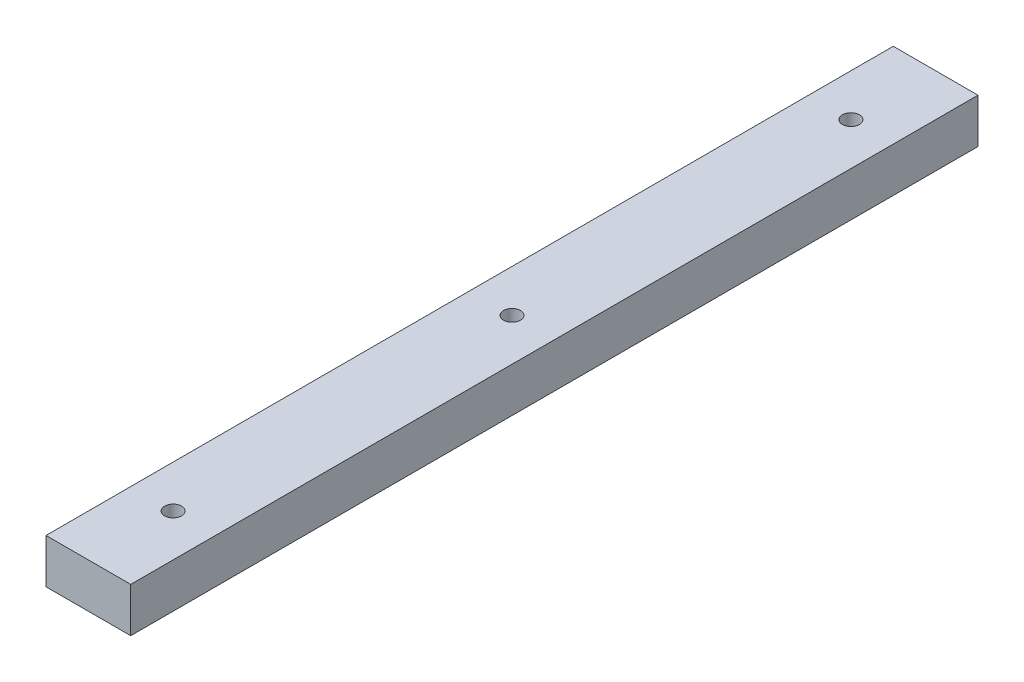
ISO-10303-21;
HEADER;
FILE_DESCRIPTION(('STEP AP214'),'2;1');
FILE_NAME('part.step','',(''),(''),'','','');
FILE_SCHEMA(('AUTOMOTIVE_DESIGN { 1 0 10303 214 1 1 1 1 }'));
ENDSEC;
DATA;
#1=APPLICATION_CONTEXT('core data for automotive mechanical design processes');
#2=APPLICATION_PROTOCOL_DEFINITION('international standard','automotive_design',2000,#1);
#3=PRODUCT_CONTEXT('',#1,'mechanical');
#4=PRODUCT('Part','Part','',(#3));
#5=PRODUCT_RELATED_PRODUCT_CATEGORY('part','',(#4));
#6=PRODUCT_DEFINITION_FORMATION('','',#4);
#7=PRODUCT_DEFINITION_CONTEXT('part definition',#1,'design');
#8=PRODUCT_DEFINITION('design','',#6,#7);
#9=PRODUCT_DEFINITION_SHAPE('','',#8);
#10=(LENGTH_UNIT() NAMED_UNIT(*) SI_UNIT(.MILLI.,.METRE.));
#11=(NAMED_UNIT(*) PLANE_ANGLE_UNIT() SI_UNIT($,.RADIAN.));
#12=(NAMED_UNIT(*) SI_UNIT($,.STERADIAN.) SOLID_ANGLE_UNIT());
#13=UNCERTAINTY_MEASURE_WITH_UNIT(LENGTH_MEASURE(1.E-05),#10,'distance_accuracy_value','');
#14=(GEOMETRIC_REPRESENTATION_CONTEXT(3) GLOBAL_UNCERTAINTY_ASSIGNED_CONTEXT((#13)) GLOBAL_UNIT_ASSIGNED_CONTEXT((#10,
#11,#12)) REPRESENTATION_CONTEXT('',''));
#15=CARTESIAN_POINT('',(0.,0.,0.));
#16=DIRECTION('',(0.,0.,1.));
#17=DIRECTION('',(1.,0.,0.));
#18=AXIS2_PLACEMENT_3D('',#15,#16,#17);
#19=CARTESIAN_POINT('',(0.,10.5,0.));
#20=DIRECTION('',(0.,-1.,0.));
#21=DIRECTION('',(0.,0.,-1.));
#22=AXIS2_PLACEMENT_3D('',#19,#20,#21);
#23=PLANE('',#22);
#24=DIRECTION('',(0.,0.,-1.));
#25=VECTOR('',#24,1.);
#26=CARTESIAN_POINT('',(10.0000000000001,10.5,100.));
#27=LINE('',#26,#25);
#28=CARTESIAN_POINT('',(10.0000000000001,10.5,100.));
#29=VERTEX_POINT('',#28);
#30=CARTESIAN_POINT('',(9.99999999999999,10.5,-99.9999999999999));
#31=VERTEX_POINT('',#30);
#32=EDGE_CURVE('E89',#29,#31,#27,.T.);
#33=ORIENTED_EDGE('',*,*,#32,.T.);
#34=DIRECTION('',(-1.,0.,0.));
#35=VECTOR('',#34,1.);
#36=CARTESIAN_POINT('',(-10.,10.5,-99.9999999999999));
#37=LINE('',#36,#35);
#38=CARTESIAN_POINT('',(-10.,10.5,-99.9999999999999));
#39=VERTEX_POINT('',#38);
#40=EDGE_CURVE('E84',#31,#39,#37,.T.);
#41=ORIENTED_EDGE('',*,*,#40,.T.);
#42=DIRECTION('',(0.,0.,1.));
#43=VECTOR('',#42,1.);
#44=CARTESIAN_POINT('',(-10.,10.5,100.));
#45=LINE('',#44,#43);
#46=CARTESIAN_POINT('',(-10.,10.5,100.));
#47=VERTEX_POINT('',#46);
#48=EDGE_CURVE('E87',#39,#47,#45,.T.);
#49=ORIENTED_EDGE('',*,*,#48,.T.);
#50=DIRECTION('',(1.,0.,0.));
#51=VECTOR('',#50,1.);
#52=CARTESIAN_POINT('',(-10.,10.5,100.));
#53=LINE('',#52,#51);
#54=EDGE_CURVE('E54',#47,#29,#53,.T.);
#55=ORIENTED_EDGE('',*,*,#54,.T.);
#56=EDGE_LOOP('',(#33,#41,#49,#55));
#57=FACE_BOUND('',#56,.T.);
#58=CARTESIAN_POINT('',(0.,10.5,-79.9999999999999));
#59=DIRECTION('',(0.,1.,0.));
#60=DIRECTION('',(0.,0.,1.));
#61=AXIS2_PLACEMENT_3D('',#58,#59,#60);
#62=CIRCLE('',#61,2.);
#63=CARTESIAN_POINT('',(0.,10.5,-77.9999999999999));
#64=VERTEX_POINT('',#63);
#65=EDGE_CURVE('E104',#64,#64,#62,.T.);
#66=ORIENTED_EDGE('',*,*,#65,.F.);
#67=EDGE_LOOP('',(#66));
#68=FACE_BOUND('',#67,.T.);
#69=CARTESIAN_POINT('',(0.,10.5,0.));
#70=DIRECTION('',(0.,1.,0.));
#71=DIRECTION('',(0.,0.,1.));
#72=AXIS2_PLACEMENT_3D('',#69,#70,#71);
#73=CIRCLE('',#72,2.);
#74=CARTESIAN_POINT('',(0.,10.5,1.99999999999999));
#75=VERTEX_POINT('',#74);
#76=EDGE_CURVE('E119',#75,#75,#73,.T.);
#77=ORIENTED_EDGE('',*,*,#76,.F.);
#78=EDGE_LOOP('',(#77));
#79=FACE_BOUND('',#78,.T.);
#80=CARTESIAN_POINT('',(0.,10.5,80.0000000000001));
#81=DIRECTION('',(0.,1.,0.));
#82=DIRECTION('',(0.,0.,1.));
#83=AXIS2_PLACEMENT_3D('',#80,#81,#82);
#84=CIRCLE('',#83,2.);
#85=CARTESIAN_POINT('',(0.,10.5,82.0000000000001));
#86=VERTEX_POINT('',#85);
#87=EDGE_CURVE('E125',#86,#86,#84,.T.);
#88=ORIENTED_EDGE('',*,*,#87,.F.);
#89=EDGE_LOOP('',(#88));
#90=FACE_BOUND('',#89,.T.);
#91=ADVANCED_FACE('F37',(#57,#68,#79,#90),#23,.F.);
#92=CARTESIAN_POINT('',(0.,0.,0.));
#93=DIRECTION('',(0.,-1.,0.));
#94=DIRECTION('',(0.,0.,-1.));
#95=AXIS2_PLACEMENT_3D('',#92,#93,#94);
#96=PLANE('',#95);
#97=CARTESIAN_POINT('',(0.,0.,0.));
#98=DIRECTION('',(0.,1.,0.));
#99=DIRECTION('',(0.,0.,1.));
#100=AXIS2_PLACEMENT_3D('',#97,#98,#99);
#101=CIRCLE('',#100,2.);
#102=CARTESIAN_POINT('',(0.,0.,1.99999999999999));
#103=VERTEX_POINT('',#102);
#104=EDGE_CURVE('E122',#103,#103,#101,.T.);
#105=ORIENTED_EDGE('',*,*,#104,.T.);
#106=EDGE_LOOP('',(#105));
#107=FACE_BOUND('',#106,.T.);
#108=DIRECTION('',(0.,0.,-1.));
#109=VECTOR('',#108,1.);
#110=CARTESIAN_POINT('',(10.0000000000001,0.,100.));
#111=LINE('',#110,#109);
#112=CARTESIAN_POINT('',(10.0000000000001,0.,100.));
#113=VERTEX_POINT('',#112);
#114=CARTESIAN_POINT('',(9.99999999999999,0.,-99.9999999999999));
#115=VERTEX_POINT('',#114);
#116=EDGE_CURVE('E101',#113,#115,#111,.T.);
#117=ORIENTED_EDGE('',*,*,#116,.F.);
#118=DIRECTION('',(1.,0.,0.));
#119=VECTOR('',#118,1.);
#120=CARTESIAN_POINT('',(-10.,0.,100.));
#121=LINE('',#120,#119);
#122=CARTESIAN_POINT('',(-10.,0.,100.));
#123=VERTEX_POINT('',#122);
#124=EDGE_CURVE('E77',#123,#113,#121,.T.);
#125=ORIENTED_EDGE('',*,*,#124,.F.);
#126=DIRECTION('',(0.,0.,1.));
#127=VECTOR('',#126,1.);
#128=CARTESIAN_POINT('',(-10.,0.,100.));
#129=LINE('',#128,#127);
#130=CARTESIAN_POINT('',(-10.,0.,-99.9999999999999));
#131=VERTEX_POINT('',#130);
#132=EDGE_CURVE('E71',#131,#123,#129,.T.);
#133=ORIENTED_EDGE('',*,*,#132,.F.);
#134=DIRECTION('',(-1.,0.,0.));
#135=VECTOR('',#134,1.);
#136=CARTESIAN_POINT('',(-10.,0.,-99.9999999999999));
#137=LINE('',#136,#135);
#138=EDGE_CURVE('E93',#115,#131,#137,.T.);
#139=ORIENTED_EDGE('',*,*,#138,.F.);
#140=EDGE_LOOP('',(#117,#125,#133,#139));
#141=FACE_BOUND('',#140,.T.);
#142=CARTESIAN_POINT('',(0.,0.,-79.9999999999999));
#143=DIRECTION('',(0.,1.,0.));
#144=DIRECTION('',(0.,0.,1.));
#145=AXIS2_PLACEMENT_3D('',#142,#143,#144);
#146=CIRCLE('',#145,2.);
#147=CARTESIAN_POINT('',(0.,0.,-77.9999999999999));
#148=VERTEX_POINT('',#147);
#149=EDGE_CURVE('E116',#148,#148,#146,.T.);
#150=ORIENTED_EDGE('',*,*,#149,.T.);
#151=EDGE_LOOP('',(#150));
#152=FACE_BOUND('',#151,.T.);
#153=CARTESIAN_POINT('',(0.,0.,80.0000000000001));
#154=DIRECTION('',(0.,1.,0.));
#155=DIRECTION('',(0.,0.,1.));
#156=AXIS2_PLACEMENT_3D('',#153,#154,#155);
#157=CIRCLE('',#156,2.);
#158=CARTESIAN_POINT('',(0.,0.,82.0000000000001));
#159=VERTEX_POINT('',#158);
#160=EDGE_CURVE('E128',#159,#159,#157,.T.);
#161=ORIENTED_EDGE('',*,*,#160,.T.);
#162=EDGE_LOOP('',(#161));
#163=FACE_BOUND('',#162,.T.);
#164=ADVANCED_FACE('F112',(#107,#141,#152,#163),#96,.T.);
#165=CARTESIAN_POINT('',(10.0000000000001,10.5,100.));
#166=DIRECTION('',(-1.,0.,0.));
#167=DIRECTION('',(0.,0.,1.));
#168=AXIS2_PLACEMENT_3D('',#165,#166,#167);
#169=PLANE('',#168);
#170=ORIENTED_EDGE('',*,*,#116,.T.);
#171=DIRECTION('',(0.,-1.,0.));
#172=VECTOR('',#171,1.);
#173=CARTESIAN_POINT('',(9.99999999999999,10.5,-99.9999999999999));
#174=LINE('',#173,#172);
#175=EDGE_CURVE('E11',#31,#115,#174,.T.);
#176=ORIENTED_EDGE('',*,*,#175,.F.);
#177=ORIENTED_EDGE('',*,*,#32,.F.);
#178=DIRECTION('',(0.,-1.,0.));
#179=VECTOR('',#178,1.);
#180=CARTESIAN_POINT('',(10.0000000000001,10.5,100.));
#181=LINE('',#180,#179);
#182=EDGE_CURVE('E97',#29,#113,#181,.T.);
#183=ORIENTED_EDGE('',*,*,#182,.T.);
#184=EDGE_LOOP('',(#170,#176,#177,#183));
#185=FACE_BOUND('',#184,.T.);
#186=ADVANCED_FACE('F39',(#185),#169,.F.);
#187=CARTESIAN_POINT('',(-10.,10.5,-99.9999999999999));
#188=DIRECTION('',(0.,0.,1.));
#189=DIRECTION('',(1.,0.,0.));
#190=AXIS2_PLACEMENT_3D('',#187,#188,#189);
#191=PLANE('',#190);
#192=ORIENTED_EDGE('',*,*,#138,.T.);
#193=DIRECTION('',(0.,-1.,0.));
#194=VECTOR('',#193,1.);
#195=CARTESIAN_POINT('',(-10.,10.5,-99.9999999999999));
#196=LINE('',#195,#194);
#197=EDGE_CURVE('E46',#39,#131,#196,.T.);
#198=ORIENTED_EDGE('',*,*,#197,.F.);
#199=ORIENTED_EDGE('',*,*,#40,.F.);
#200=ORIENTED_EDGE('',*,*,#175,.T.);
#201=EDGE_LOOP('',(#192,#198,#199,#200));
#202=FACE_BOUND('',#201,.T.);
#203=ADVANCED_FACE('F92',(#202),#191,.F.);
#204=CARTESIAN_POINT('',(-10.,10.5,100.));
#205=DIRECTION('',(1.,0.,0.));
#206=DIRECTION('',(0.,0.,-1.));
#207=AXIS2_PLACEMENT_3D('',#204,#205,#206);
#208=PLANE('',#207);
#209=ORIENTED_EDGE('',*,*,#132,.T.);
#210=DIRECTION('',(0.,-1.,0.));
#211=VECTOR('',#210,1.);
#212=CARTESIAN_POINT('',(-10.,10.5,100.));
#213=LINE('',#212,#211);
#214=EDGE_CURVE('E94',#47,#123,#213,.T.);
#215=ORIENTED_EDGE('',*,*,#214,.F.);
#216=ORIENTED_EDGE('',*,*,#48,.F.);
#217=ORIENTED_EDGE('',*,*,#197,.T.);
#218=EDGE_LOOP('',(#209,#215,#216,#217));
#219=FACE_BOUND('',#218,.T.);
#220=ADVANCED_FACE('F95',(#219),#208,.F.);
#221=CARTESIAN_POINT('',(-10.,10.5,100.));
#222=DIRECTION('',(0.,0.,-1.));
#223=DIRECTION('',(-1.,0.,0.));
#224=AXIS2_PLACEMENT_3D('',#221,#222,#223);
#225=PLANE('',#224);
#226=ORIENTED_EDGE('',*,*,#124,.T.);
#227=ORIENTED_EDGE('',*,*,#182,.F.);
#228=ORIENTED_EDGE('',*,*,#54,.F.);
#229=ORIENTED_EDGE('',*,*,#214,.T.);
#230=EDGE_LOOP('',(#226,#227,#228,#229));
#231=FACE_BOUND('',#230,.T.);
#232=ADVANCED_FACE('F109',(#231),#225,.F.);
#233=CARTESIAN_POINT('',(0.,10.5,-79.9999999999999));
#234=DIRECTION('',(0.,-1.,0.));
#235=DIRECTION('',(0.,0.,-1.));
#236=AXIS2_PLACEMENT_3D('',#233,#234,#235);
#237=CYLINDRICAL_SURFACE('',#236,2.);
#238=ORIENTED_EDGE('',*,*,#65,.T.);
#239=EDGE_LOOP('',(#238));
#240=FACE_BOUND('',#239,.T.);
#241=ORIENTED_EDGE('',*,*,#149,.F.);
#242=EDGE_LOOP('',(#241));
#243=FACE_BOUND('',#242,.T.);
#244=ADVANCED_FACE('F145',(#240,#243),#237,.F.);
#245=CARTESIAN_POINT('',(0.,10.5,0.));
#246=DIRECTION('',(0.,-1.,0.));
#247=DIRECTION('',(0.,0.,-1.));
#248=AXIS2_PLACEMENT_3D('',#245,#246,#247);
#249=CYLINDRICAL_SURFACE('',#248,2.);
#250=ORIENTED_EDGE('',*,*,#76,.T.);
#251=EDGE_LOOP('',(#250));
#252=FACE_BOUND('',#251,.T.);
#253=ORIENTED_EDGE('',*,*,#104,.F.);
#254=EDGE_LOOP('',(#253));
#255=FACE_BOUND('',#254,.T.);
#256=ADVANCED_FACE('F199',(#252,#255),#249,.F.);
#257=CARTESIAN_POINT('',(0.,10.5,80.0000000000001));
#258=DIRECTION('',(0.,-1.,0.));
#259=DIRECTION('',(0.,0.,-1.));
#260=AXIS2_PLACEMENT_3D('',#257,#258,#259);
#261=CYLINDRICAL_SURFACE('',#260,2.);
#262=ORIENTED_EDGE('',*,*,#87,.T.);
#263=EDGE_LOOP('',(#262));
#264=FACE_BOUND('',#263,.T.);
#265=ORIENTED_EDGE('',*,*,#160,.F.);
#266=EDGE_LOOP('',(#265));
#267=FACE_BOUND('',#266,.T.);
#268=ADVANCED_FACE('F134',(#264,#267),#261,.F.);
#269=CLOSED_SHELL('',(#91,#164,#186,#203,#220,#232,#244,#256,#268));
#270=MANIFOLD_SOLID_BREP('B2',#269);
#271=ADVANCED_BREP_SHAPE_REPRESENTATION('',(#18,#270),#14);
#272=SHAPE_DEFINITION_REPRESENTATION(#9,#271);
ENDSEC;
END-ISO-10303-21;
